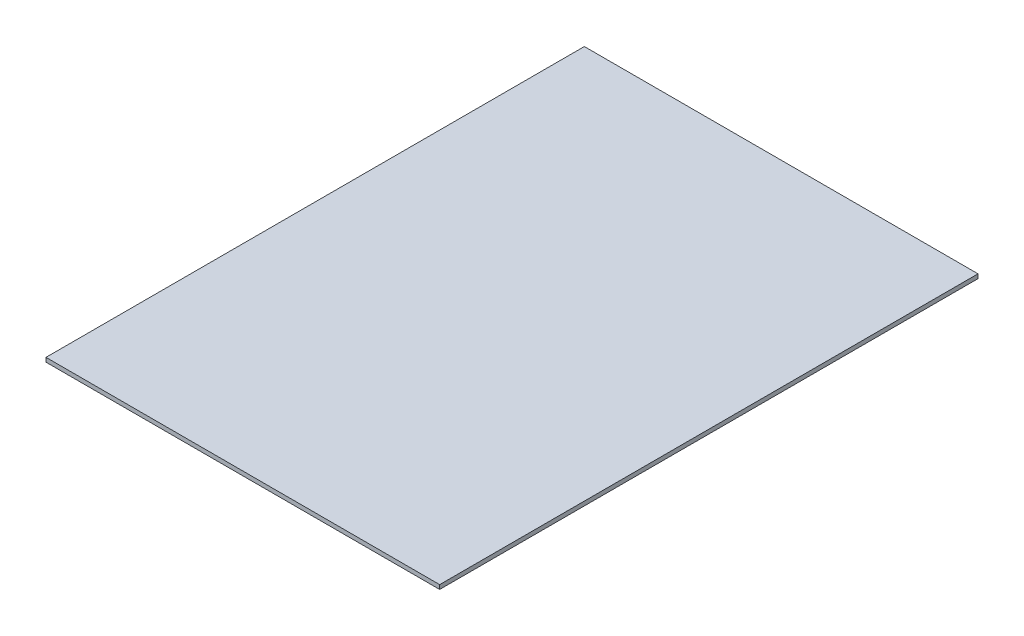
ISO-10303-21;
HEADER;
FILE_DESCRIPTION(('STEP AP214'),'2;1');
FILE_NAME('part.step','',(''),(''),'','','');
FILE_SCHEMA(('AUTOMOTIVE_DESIGN { 1 0 10303 214 1 1 1 1 }'));
ENDSEC;
DATA;
#1=APPLICATION_CONTEXT('core data for automotive mechanical design processes');
#2=APPLICATION_PROTOCOL_DEFINITION('international standard','automotive_design',2000,#1);
#3=PRODUCT_CONTEXT('',#1,'mechanical');
#4=PRODUCT('Part','Part','',(#3));
#5=PRODUCT_RELATED_PRODUCT_CATEGORY('part','',(#4));
#6=PRODUCT_DEFINITION_FORMATION('','',#4);
#7=PRODUCT_DEFINITION_CONTEXT('part definition',#1,'design');
#8=PRODUCT_DEFINITION('design','',#6,#7);
#9=PRODUCT_DEFINITION_SHAPE('','',#8);
#10=(LENGTH_UNIT() NAMED_UNIT(*) SI_UNIT(.MILLI.,.METRE.));
#11=(NAMED_UNIT(*) PLANE_ANGLE_UNIT() SI_UNIT($,.RADIAN.));
#12=(NAMED_UNIT(*) SI_UNIT($,.STERADIAN.) SOLID_ANGLE_UNIT());
#13=UNCERTAINTY_MEASURE_WITH_UNIT(LENGTH_MEASURE(1.E-05),#10,'distance_accuracy_value','');
#14=(GEOMETRIC_REPRESENTATION_CONTEXT(3) GLOBAL_UNCERTAINTY_ASSIGNED_CONTEXT((#13)) GLOBAL_UNIT_ASSIGNED_CONTEXT((#10,
#11,#12)) REPRESENTATION_CONTEXT('',''));
#15=CARTESIAN_POINT('',(0.,0.,0.));
#16=DIRECTION('',(0.,0.,1.));
#17=DIRECTION('',(1.,0.,0.));
#18=AXIS2_PLACEMENT_3D('',#15,#16,#17);
#19=CARTESIAN_POINT('',(117.,2.5,160.));
#20=DIRECTION('',(-1.,0.,0.));
#21=DIRECTION('',(0.,0.,1.));
#22=AXIS2_PLACEMENT_3D('',#19,#20,#21);
#23=PLANE('',#22);
#24=DIRECTION('',(0.,0.,-1.));
#25=VECTOR('',#24,1.);
#26=CARTESIAN_POINT('',(117.,0.,160.));
#27=LINE('',#26,#25);
#28=CARTESIAN_POINT('',(117.,0.,160.));
#29=VERTEX_POINT('',#28);
#30=CARTESIAN_POINT('',(117.,0.,-160.));
#31=VERTEX_POINT('',#30);
#32=EDGE_CURVE('E97',#29,#31,#27,.T.);
#33=ORIENTED_EDGE('',*,*,#32,.T.);
#34=DIRECTION('',(0.,-1.,0.));
#35=VECTOR('',#34,1.);
#36=CARTESIAN_POINT('',(117.,2.5,-160.));
#37=LINE('',#36,#35);
#38=CARTESIAN_POINT('',(117.,2.5,-160.));
#39=VERTEX_POINT('',#38);
#40=EDGE_CURVE('E11',#39,#31,#37,.T.);
#41=ORIENTED_EDGE('',*,*,#40,.F.);
#42=DIRECTION('',(0.,0.,-1.));
#43=VECTOR('',#42,1.);
#44=CARTESIAN_POINT('',(117.,2.5,160.));
#45=LINE('',#44,#43);
#46=CARTESIAN_POINT('',(117.,2.5,160.));
#47=VERTEX_POINT('',#46);
#48=EDGE_CURVE('E85',#47,#39,#45,.T.);
#49=ORIENTED_EDGE('',*,*,#48,.F.);
#50=DIRECTION('',(0.,-1.,0.));
#51=VECTOR('',#50,1.);
#52=CARTESIAN_POINT('',(117.,2.5,160.));
#53=LINE('',#52,#51);
#54=EDGE_CURVE('E93',#47,#29,#53,.T.);
#55=ORIENTED_EDGE('',*,*,#54,.T.);
#56=EDGE_LOOP('',(#33,#41,#49,#55));
#57=FACE_BOUND('',#56,.T.);
#58=ADVANCED_FACE('F34',(#57),#23,.F.);
#59=CARTESIAN_POINT('',(-117.,2.5,-160.));
#60=DIRECTION('',(0.,0.,1.));
#61=DIRECTION('',(1.,0.,0.));
#62=AXIS2_PLACEMENT_3D('',#59,#60,#61);
#63=PLANE('',#62);
#64=DIRECTION('',(-1.,0.,0.));
#65=VECTOR('',#64,1.);
#66=CARTESIAN_POINT('',(-117.,0.,-160.));
#67=LINE('',#66,#65);
#68=CARTESIAN_POINT('',(-117.,0.,-160.));
#69=VERTEX_POINT('',#68);
#70=EDGE_CURVE('E89',#31,#69,#67,.T.);
#71=ORIENTED_EDGE('',*,*,#70,.T.);
#72=DIRECTION('',(0.,-1.,0.));
#73=VECTOR('',#72,1.);
#74=CARTESIAN_POINT('',(-117.,2.5,-160.));
#75=LINE('',#74,#73);
#76=CARTESIAN_POINT('',(-117.,2.5,-160.));
#77=VERTEX_POINT('',#76);
#78=EDGE_CURVE('E42',#77,#69,#75,.T.);
#79=ORIENTED_EDGE('',*,*,#78,.F.);
#80=DIRECTION('',(-1.,0.,0.));
#81=VECTOR('',#80,1.);
#82=CARTESIAN_POINT('',(-117.,2.5,-160.));
#83=LINE('',#82,#81);
#84=EDGE_CURVE('E80',#39,#77,#83,.T.);
#85=ORIENTED_EDGE('',*,*,#84,.F.);
#86=ORIENTED_EDGE('',*,*,#40,.T.);
#87=EDGE_LOOP('',(#71,#79,#85,#86));
#88=FACE_BOUND('',#87,.T.);
#89=ADVANCED_FACE('F88',(#88),#63,.F.);
#90=CARTESIAN_POINT('',(-117.,2.5,160.));
#91=DIRECTION('',(1.,0.,0.));
#92=DIRECTION('',(0.,0.,-1.));
#93=AXIS2_PLACEMENT_3D('',#90,#91,#92);
#94=PLANE('',#93);
#95=DIRECTION('',(0.,0.,1.));
#96=VECTOR('',#95,1.);
#97=CARTESIAN_POINT('',(-117.,0.,160.));
#98=LINE('',#97,#96);
#99=CARTESIAN_POINT('',(-117.,0.,160.));
#100=VERTEX_POINT('',#99);
#101=EDGE_CURVE('E67',#69,#100,#98,.T.);
#102=ORIENTED_EDGE('',*,*,#101,.T.);
#103=DIRECTION('',(0.,-1.,0.));
#104=VECTOR('',#103,1.);
#105=CARTESIAN_POINT('',(-117.,2.5,160.));
#106=LINE('',#105,#104);
#107=CARTESIAN_POINT('',(-117.,2.5,160.));
#108=VERTEX_POINT('',#107);
#109=EDGE_CURVE('E90',#108,#100,#106,.T.);
#110=ORIENTED_EDGE('',*,*,#109,.F.);
#111=DIRECTION('',(0.,0.,1.));
#112=VECTOR('',#111,1.);
#113=CARTESIAN_POINT('',(-117.,2.5,160.));
#114=LINE('',#113,#112);
#115=EDGE_CURVE('E83',#77,#108,#114,.T.);
#116=ORIENTED_EDGE('',*,*,#115,.F.);
#117=ORIENTED_EDGE('',*,*,#78,.T.);
#118=EDGE_LOOP('',(#102,#110,#116,#117));
#119=FACE_BOUND('',#118,.T.);
#120=ADVANCED_FACE('F91',(#119),#94,.F.);
#121=CARTESIAN_POINT('',(-117.,2.5,160.));
#122=DIRECTION('',(0.,0.,-1.));
#123=DIRECTION('',(-1.,0.,0.));
#124=AXIS2_PLACEMENT_3D('',#121,#122,#123);
#125=PLANE('',#124);
#126=DIRECTION('',(1.,0.,0.));
#127=VECTOR('',#126,1.);
#128=CARTESIAN_POINT('',(-117.,0.,160.));
#129=LINE('',#128,#127);
#130=EDGE_CURVE('E73',#100,#29,#129,.T.);
#131=ORIENTED_EDGE('',*,*,#130,.T.);
#132=ORIENTED_EDGE('',*,*,#54,.F.);
#133=DIRECTION('',(1.,0.,0.));
#134=VECTOR('',#133,1.);
#135=CARTESIAN_POINT('',(-117.,2.5,160.));
#136=LINE('',#135,#134);
#137=EDGE_CURVE('E50',#108,#47,#136,.T.);
#138=ORIENTED_EDGE('',*,*,#137,.F.);
#139=ORIENTED_EDGE('',*,*,#109,.T.);
#140=EDGE_LOOP('',(#131,#132,#138,#139));
#141=FACE_BOUND('',#140,.T.);
#142=ADVANCED_FACE('F104',(#141),#125,.F.);
#143=CARTESIAN_POINT('',(0.,2.5,0.));
#144=DIRECTION('',(0.,-1.,0.));
#145=DIRECTION('',(0.,0.,-1.));
#146=AXIS2_PLACEMENT_3D('',#143,#144,#145);
#147=PLANE('',#146);
#148=ORIENTED_EDGE('',*,*,#48,.T.);
#149=ORIENTED_EDGE('',*,*,#84,.T.);
#150=ORIENTED_EDGE('',*,*,#115,.T.);
#151=ORIENTED_EDGE('',*,*,#137,.T.);
#152=EDGE_LOOP('',(#148,#149,#150,#151));
#153=FACE_BOUND('',#152,.T.);
#154=ADVANCED_FACE('F81',(#153),#147,.F.);
#155=CARTESIAN_POINT('',(0.,0.,0.));
#156=DIRECTION('',(0.,-1.,0.));
#157=DIRECTION('',(0.,0.,-1.));
#158=AXIS2_PLACEMENT_3D('',#155,#156,#157);
#159=PLANE('',#158);
#160=ORIENTED_EDGE('',*,*,#32,.F.);
#161=ORIENTED_EDGE('',*,*,#130,.F.);
#162=ORIENTED_EDGE('',*,*,#101,.F.);
#163=ORIENTED_EDGE('',*,*,#70,.F.);
#164=EDGE_LOOP('',(#160,#161,#162,#163));
#165=FACE_BOUND('',#164,.T.);
#166=ADVANCED_FACE('F107',(#165),#159,.T.);
#167=CLOSED_SHELL('',(#58,#89,#120,#142,#154,#166));
#168=MANIFOLD_SOLID_BREP('B2',#167);
#169=ADVANCED_BREP_SHAPE_REPRESENTATION('',(#18,#168),#14);
#170=SHAPE_DEFINITION_REPRESENTATION(#9,#169);
ENDSEC;
END-ISO-10303-21;
